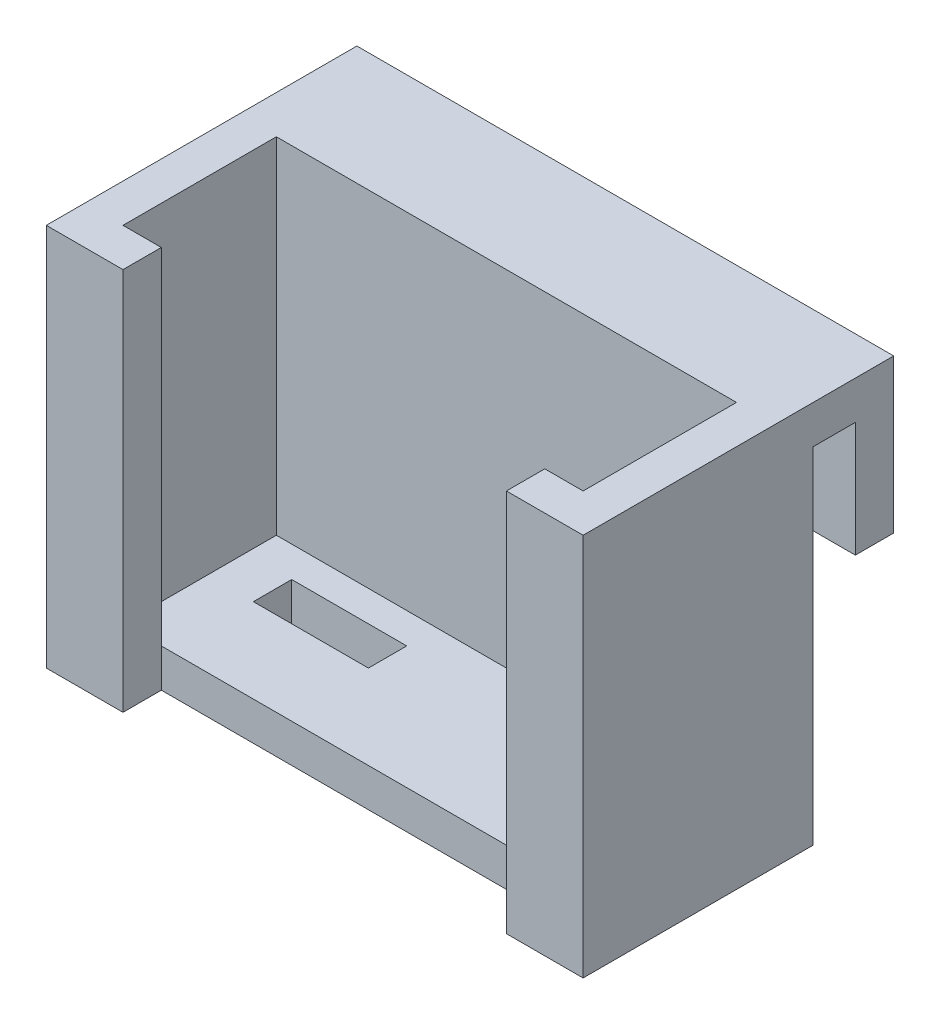
ISO-10303-21;
HEADER;
FILE_DESCRIPTION(('STEP AP214'),'2;1');
FILE_NAME('part.step','',(''),(''),'','','');
FILE_SCHEMA(('AUTOMOTIVE_DESIGN { 1 0 10303 214 1 1 1 1 }'));
ENDSEC;
DATA;
#1=APPLICATION_CONTEXT('core data for automotive mechanical design processes');
#2=APPLICATION_PROTOCOL_DEFINITION('international standard','automotive_design',2000,#1);
#3=PRODUCT_CONTEXT('',#1,'mechanical');
#4=PRODUCT('Part','Part','',(#3));
#5=PRODUCT_RELATED_PRODUCT_CATEGORY('part','',(#4));
#6=PRODUCT_DEFINITION_FORMATION('','',#4);
#7=PRODUCT_DEFINITION_CONTEXT('part definition',#1,'design');
#8=PRODUCT_DEFINITION('design','',#6,#7);
#9=PRODUCT_DEFINITION_SHAPE('','',#8);
#10=(LENGTH_UNIT() NAMED_UNIT(*) SI_UNIT(.MILLI.,.METRE.));
#11=(NAMED_UNIT(*) PLANE_ANGLE_UNIT() SI_UNIT($,.RADIAN.));
#12=(NAMED_UNIT(*) SI_UNIT($,.STERADIAN.) SOLID_ANGLE_UNIT());
#13=UNCERTAINTY_MEASURE_WITH_UNIT(LENGTH_MEASURE(1.E-05),#10,'distance_accuracy_value','');
#14=(GEOMETRIC_REPRESENTATION_CONTEXT(3) GLOBAL_UNCERTAINTY_ASSIGNED_CONTEXT((#13)) GLOBAL_UNIT_ASSIGNED_CONTEXT((#10,
#11,#12)) REPRESENTATION_CONTEXT('',''));
#15=CARTESIAN_POINT('',(0.,0.,0.));
#16=DIRECTION('',(0.,0.,1.));
#17=DIRECTION('',(1.,0.,0.));
#18=AXIS2_PLACEMENT_3D('',#15,#16,#17);
#19=CARTESIAN_POINT('',(30.,5.,9.99999999999999));
#20=DIRECTION('',(0.,0.,-1.));
#21=DIRECTION('',(-1.,0.,0.));
#22=AXIS2_PLACEMENT_3D('',#19,#20,#21);
#23=PLANE('',#22);
#24=DIRECTION('',(0.,1.,0.));
#25=VECTOR('',#24,1.);
#26=CARTESIAN_POINT('',(-25.,0.,10.));
#27=LINE('',#26,#25);
#28=CARTESIAN_POINT('',(-25.,0.,10.));
#29=VERTEX_POINT('',#28);
#30=CARTESIAN_POINT('',(-25.,5.,10.));
#31=VERTEX_POINT('',#30);
#32=EDGE_CURVE('E254',#29,#31,#27,.T.);
#33=ORIENTED_EDGE('',*,*,#32,.F.);
#34=DIRECTION('',(1.,0.,0.));
#35=VECTOR('',#34,1.);
#36=CARTESIAN_POINT('',(30.,0.,9.99999999999999));
#37=LINE('',#36,#35);
#38=CARTESIAN_POINT('',(25.,0.,10.));
#39=VERTEX_POINT('',#38);
#40=EDGE_CURVE('E46',#29,#39,#37,.T.);
#41=ORIENTED_EDGE('',*,*,#40,.T.);
#42=DIRECTION('',(0.,-1.,0.));
#43=VECTOR('',#42,1.);
#44=CARTESIAN_POINT('',(25.,0.,10.));
#45=LINE('',#44,#43);
#46=CARTESIAN_POINT('',(25.,5.,9.99999999999999));
#47=VERTEX_POINT('',#46);
#48=EDGE_CURVE('E11',#47,#39,#45,.T.);
#49=ORIENTED_EDGE('',*,*,#48,.F.);
#50=DIRECTION('',(1.,0.,0.));
#51=VECTOR('',#50,1.);
#52=CARTESIAN_POINT('',(30.,5.,9.99999999999999));
#53=LINE('',#52,#51);
#54=EDGE_CURVE('E69',#31,#47,#53,.T.);
#55=ORIENTED_EDGE('',*,*,#54,.F.);
#56=EDGE_LOOP('',(#33,#41,#49,#55));
#57=FACE_BOUND('',#56,.T.);
#58=ADVANCED_FACE('F43',(#57),#23,.F.);
#59=CARTESIAN_POINT('',(0.,5.,0.));
#60=DIRECTION('',(0.,-1.,0.));
#61=DIRECTION('',(0.,0.,-1.));
#62=AXIS2_PLACEMENT_3D('',#59,#60,#61);
#63=PLANE('',#62);
#64=DIRECTION('',(-1.,0.,0.));
#65=VECTOR('',#64,1.);
#66=CARTESIAN_POINT('',(-8.99999999999999,5.,-6.00000000000001));
#67=LINE('',#66,#65);
#68=CARTESIAN_POINT('',(-8.99999999999999,5.,-6.00000000000001));
#69=VERTEX_POINT('',#68);
#70=CARTESIAN_POINT('',(-24.,5.,-6.));
#71=VERTEX_POINT('',#70);
#72=EDGE_CURVE('E363',#69,#71,#67,.T.);
#73=ORIENTED_EDGE('',*,*,#72,.F.);
#74=DIRECTION('',(0.,0.,-1.));
#75=VECTOR('',#74,1.);
#76=CARTESIAN_POINT('',(-8.99999999999999,5.,-1.00000000000001));
#77=LINE('',#76,#75);
#78=CARTESIAN_POINT('',(-8.99999999999999,5.,-1.00000000000001));
#79=VERTEX_POINT('',#78);
#80=EDGE_CURVE('E332',#79,#69,#77,.T.);
#81=ORIENTED_EDGE('',*,*,#80,.F.);
#82=DIRECTION('',(1.,0.,0.));
#83=VECTOR('',#82,1.);
#84=CARTESIAN_POINT('',(-8.99999999999999,5.,-1.00000000000001));
#85=LINE('',#84,#83);
#86=CARTESIAN_POINT('',(-24.,5.,-1.));
#87=VERTEX_POINT('',#86);
#88=EDGE_CURVE('E348',#87,#79,#85,.T.);
#89=ORIENTED_EDGE('',*,*,#88,.F.);
#90=DIRECTION('',(0.,0.,1.));
#91=VECTOR('',#90,1.);
#92=CARTESIAN_POINT('',(-24.,5.,-1.));
#93=LINE('',#92,#91);
#94=EDGE_CURVE('E367',#71,#87,#93,.T.);
#95=ORIENTED_EDGE('',*,*,#94,.F.);
#96=EDGE_LOOP('',(#73,#81,#89,#95));
#97=FACE_BOUND('',#96,.T.);
#98=DIRECTION('',(0.,0.,1.));
#99=VECTOR('',#98,1.);
#100=CARTESIAN_POINT('',(-30.,5.,-10.));
#101=LINE('',#100,#99);
#102=CARTESIAN_POINT('',(-30.,5.,-10.));
#103=VERTEX_POINT('',#102);
#104=CARTESIAN_POINT('',(-30.,5.,10.));
#105=VERTEX_POINT('',#104);
#106=EDGE_CURVE('E386',#103,#105,#101,.T.);
#107=ORIENTED_EDGE('',*,*,#106,.T.);
#108=EDGE_CURVE('E391',#105,#31,#53,.T.);
#109=ORIENTED_EDGE('',*,*,#108,.T.);
#110=ORIENTED_EDGE('',*,*,#54,.T.);
#111=CARTESIAN_POINT('',(30.,5.,9.99999999999999));
#112=VERTEX_POINT('',#111);
#113=EDGE_CURVE('E390',#47,#112,#53,.T.);
#114=ORIENTED_EDGE('',*,*,#113,.T.);
#115=DIRECTION('',(0.,0.,-1.));
#116=VECTOR('',#115,1.);
#117=CARTESIAN_POINT('',(30.,5.,-10.));
#118=LINE('',#117,#116);
#119=CARTESIAN_POINT('',(30.,5.,-10.));
#120=VERTEX_POINT('',#119);
#121=EDGE_CURVE('E394',#112,#120,#118,.T.);
#122=ORIENTED_EDGE('',*,*,#121,.T.);
#123=DIRECTION('',(-1.,0.,0.));
#124=VECTOR('',#123,1.);
#125=CARTESIAN_POINT('',(30.,5.,-10.));
#126=LINE('',#125,#124);
#127=EDGE_CURVE('E52',#120,#103,#126,.T.);
#128=ORIENTED_EDGE('',*,*,#127,.T.);
#129=EDGE_LOOP('',(#107,#109,#110,#114,#122,#128));
#130=FACE_BOUND('',#129,.T.);
#131=ADVANCED_FACE('F401',(#97,#130),#63,.F.);
#132=CARTESIAN_POINT('',(0.,0.,0.));
#133=DIRECTION('',(0.,-1.,0.));
#134=DIRECTION('',(0.,0.,-1.));
#135=AXIS2_PLACEMENT_3D('',#132,#133,#134);
#136=PLANE('',#135);
#137=DIRECTION('',(0.,0.,-1.));
#138=VECTOR('',#137,1.);
#139=CARTESIAN_POINT('',(-8.99999999999999,0.,-1.00000000000001));
#140=LINE('',#139,#138);
#141=CARTESIAN_POINT('',(-8.99999999999999,0.,-1.00000000000001));
#142=VERTEX_POINT('',#141);
#143=CARTESIAN_POINT('',(-8.99999999999999,0.,-6.00000000000001));
#144=VERTEX_POINT('',#143);
#145=EDGE_CURVE('E343',#142,#144,#140,.T.);
#146=ORIENTED_EDGE('',*,*,#145,.T.);
#147=DIRECTION('',(-1.,0.,0.));
#148=VECTOR('',#147,1.);
#149=CARTESIAN_POINT('',(-8.99999999999999,0.,-6.00000000000001));
#150=LINE('',#149,#148);
#151=CARTESIAN_POINT('',(-24.,0.,-6.));
#152=VERTEX_POINT('',#151);
#153=EDGE_CURVE('E347',#144,#152,#150,.T.);
#154=ORIENTED_EDGE('',*,*,#153,.T.);
#155=DIRECTION('',(0.,0.,1.));
#156=VECTOR('',#155,1.);
#157=CARTESIAN_POINT('',(-24.,0.,-1.));
#158=LINE('',#157,#156);
#159=CARTESIAN_POINT('',(-24.,0.,-1.));
#160=VERTEX_POINT('',#159);
#161=EDGE_CURVE('E352',#152,#160,#158,.T.);
#162=ORIENTED_EDGE('',*,*,#161,.T.);
#163=DIRECTION('',(1.,0.,0.));
#164=VECTOR('',#163,1.);
#165=CARTESIAN_POINT('',(-8.99999999999999,0.,-1.00000000000001));
#166=LINE('',#165,#164);
#167=EDGE_CURVE('E356',#160,#142,#166,.T.);
#168=ORIENTED_EDGE('',*,*,#167,.T.);
#169=EDGE_LOOP('',(#146,#154,#162,#168));
#170=FACE_BOUND('',#169,.T.);
#171=ORIENTED_EDGE('',*,*,#40,.F.);
#172=DIRECTION('',(0.,0.,-1.));
#173=VECTOR('',#172,1.);
#174=CARTESIAN_POINT('',(-25.,0.,15.));
#175=LINE('',#174,#173);
#176=CARTESIAN_POINT('',(-25.,0.,15.));
#177=VERTEX_POINT('',#176);
#178=EDGE_CURVE('E264',#177,#29,#175,.T.);
#179=ORIENTED_EDGE('',*,*,#178,.F.);
#180=DIRECTION('',(1.,0.,0.));
#181=VECTOR('',#180,1.);
#182=CARTESIAN_POINT('',(-35.,0.,15.));
#183=LINE('',#182,#181);
#184=CARTESIAN_POINT('',(-35.,0.,15.));
#185=VERTEX_POINT('',#184);
#186=EDGE_CURVE('E242',#185,#177,#183,.T.);
#187=ORIENTED_EDGE('',*,*,#186,.F.);
#188=DIRECTION('',(0.,0.,1.));
#189=VECTOR('',#188,1.);
#190=CARTESIAN_POINT('',(-35.,0.,-15.));
#191=LINE('',#190,#189);
#192=CARTESIAN_POINT('',(-35.,0.,-15.));
#193=VERTEX_POINT('',#192);
#194=EDGE_CURVE('E298',#193,#185,#191,.T.);
#195=ORIENTED_EDGE('',*,*,#194,.F.);
#196=DIRECTION('',(-1.,0.,0.));
#197=VECTOR('',#196,1.);
#198=CARTESIAN_POINT('',(30.,0.,-15.));
#199=LINE('',#198,#197);
#200=CARTESIAN_POINT('',(35.,0.,-15.));
#201=VERTEX_POINT('',#200);
#202=EDGE_CURVE('E328',#201,#193,#199,.T.);
#203=ORIENTED_EDGE('',*,*,#202,.F.);
#204=DIRECTION('',(0.,0.,-1.));
#205=VECTOR('',#204,1.);
#206=CARTESIAN_POINT('',(35.,0.,-15.));
#207=LINE('',#206,#205);
#208=CARTESIAN_POINT('',(35.,0.,15.));
#209=VERTEX_POINT('',#208);
#210=EDGE_CURVE('E318',#209,#201,#207,.T.);
#211=ORIENTED_EDGE('',*,*,#210,.F.);
#212=DIRECTION('',(1.,0.,0.));
#213=VECTOR('',#212,1.);
#214=CARTESIAN_POINT('',(35.,0.,15.));
#215=LINE('',#214,#213);
#216=CARTESIAN_POINT('',(25.,0.,15.));
#217=VERTEX_POINT('',#216);
#218=EDGE_CURVE('E278',#217,#209,#215,.T.);
#219=ORIENTED_EDGE('',*,*,#218,.F.);
#220=DIRECTION('',(0.,0.,-1.));
#221=VECTOR('',#220,1.);
#222=CARTESIAN_POINT('',(25.,0.,15.));
#223=LINE('',#222,#221);
#224=EDGE_CURVE('E282',#217,#39,#223,.T.);
#225=ORIENTED_EDGE('',*,*,#224,.T.);
#226=EDGE_LOOP('',(#171,#179,#187,#195,#203,#211,#219,#225));
#227=FACE_BOUND('',#226,.T.);
#228=ADVANCED_FACE('F470',(#170,#227),#136,.T.);
#229=CARTESIAN_POINT('',(-8.99999999999999,0.,-1.00000000000001));
#230=DIRECTION('',(1.,0.,0.));
#231=DIRECTION('',(0.,0.,-1.));
#232=AXIS2_PLACEMENT_3D('',#229,#230,#231);
#233=PLANE('',#232);
#234=ORIENTED_EDGE('',*,*,#80,.T.);
#235=DIRECTION('',(0.,1.,0.));
#236=VECTOR('',#235,1.);
#237=CARTESIAN_POINT('',(-8.99999999999999,0.,-6.00000000000001));
#238=LINE('',#237,#236);
#239=EDGE_CURVE('E360',#144,#69,#238,.T.);
#240=ORIENTED_EDGE('',*,*,#239,.F.);
#241=ORIENTED_EDGE('',*,*,#145,.F.);
#242=DIRECTION('',(0.,1.,0.));
#243=VECTOR('',#242,1.);
#244=CARTESIAN_POINT('',(-8.99999999999999,0.,-1.00000000000001));
#245=LINE('',#244,#243);
#246=EDGE_CURVE('E374',#142,#79,#245,.T.);
#247=ORIENTED_EDGE('',*,*,#246,.T.);
#248=EDGE_LOOP('',(#234,#240,#241,#247));
#249=FACE_BOUND('',#248,.T.);
#250=ADVANCED_FACE('F481',(#249),#233,.F.);
#251=CARTESIAN_POINT('',(-8.99999999999999,0.,-1.00000000000001));
#252=DIRECTION('',(0.,0.,1.));
#253=DIRECTION('',(1.,0.,0.));
#254=AXIS2_PLACEMENT_3D('',#251,#252,#253);
#255=PLANE('',#254);
#256=ORIENTED_EDGE('',*,*,#88,.T.);
#257=ORIENTED_EDGE('',*,*,#246,.F.);
#258=ORIENTED_EDGE('',*,*,#167,.F.);
#259=DIRECTION('',(0.,1.,0.));
#260=VECTOR('',#259,1.);
#261=CARTESIAN_POINT('',(-24.,0.,-1.));
#262=LINE('',#261,#260);
#263=EDGE_CURVE('E377',#160,#87,#262,.T.);
#264=ORIENTED_EDGE('',*,*,#263,.T.);
#265=EDGE_LOOP('',(#256,#257,#258,#264));
#266=FACE_BOUND('',#265,.T.);
#267=ADVANCED_FACE('F487',(#266),#255,.F.);
#268=CARTESIAN_POINT('',(-24.,0.,-1.));
#269=DIRECTION('',(-1.,0.,0.));
#270=DIRECTION('',(0.,0.,1.));
#271=AXIS2_PLACEMENT_3D('',#268,#269,#270);
#272=PLANE('',#271);
#273=ORIENTED_EDGE('',*,*,#94,.T.);
#274=ORIENTED_EDGE('',*,*,#263,.F.);
#275=ORIENTED_EDGE('',*,*,#161,.F.);
#276=DIRECTION('',(0.,1.,0.));
#277=VECTOR('',#276,1.);
#278=CARTESIAN_POINT('',(-24.,0.,-6.));
#279=LINE('',#278,#277);
#280=EDGE_CURVE('E380',#152,#71,#279,.T.);
#281=ORIENTED_EDGE('',*,*,#280,.T.);
#282=EDGE_LOOP('',(#273,#274,#275,#281));
#283=FACE_BOUND('',#282,.T.);
#284=ADVANCED_FACE('F493',(#283),#272,.F.);
#285=CARTESIAN_POINT('',(-8.99999999999999,0.,-6.00000000000001));
#286=DIRECTION('',(0.,0.,-1.));
#287=DIRECTION('',(-1.,0.,0.));
#288=AXIS2_PLACEMENT_3D('',#285,#286,#287);
#289=PLANE('',#288);
#290=ORIENTED_EDGE('',*,*,#72,.T.);
#291=ORIENTED_EDGE('',*,*,#280,.F.);
#292=ORIENTED_EDGE('',*,*,#153,.F.);
#293=ORIENTED_EDGE('',*,*,#239,.T.);
#294=EDGE_LOOP('',(#290,#291,#292,#293));
#295=FACE_BOUND('',#294,.T.);
#296=ADVANCED_FACE('F489',(#295),#289,.F.);
#297=CARTESIAN_POINT('',(0.,0.,-10.));
#298=DIRECTION('',(0.,0.,1.));
#299=DIRECTION('',(1.,0.,0.));
#300=AXIS2_PLACEMENT_3D('',#297,#298,#299);
#301=PLANE('',#300);
#302=ORIENTED_EDGE('',*,*,#127,.F.);
#303=DIRECTION('',(0.,-1.,0.));
#304=VECTOR('',#303,1.);
#305=CARTESIAN_POINT('',(30.,0.,-10.));
#306=LINE('',#305,#304);
#307=CARTESIAN_POINT('',(30.,50.,-10.));
#308=VERTEX_POINT('',#307);
#309=EDGE_CURVE('E322',#308,#120,#306,.T.);
#310=ORIENTED_EDGE('',*,*,#309,.F.);
#311=DIRECTION('',(1.,0.,0.));
#312=VECTOR('',#311,1.);
#313=CARTESIAN_POINT('',(30.,50.,-10.));
#314=LINE('',#313,#312);
#315=CARTESIAN_POINT('',(-30.,50.,-10.));
#316=VERTEX_POINT('',#315);
#317=EDGE_CURVE('E333',#316,#308,#314,.T.);
#318=ORIENTED_EDGE('',*,*,#317,.F.);
#319=DIRECTION('',(0.,1.,0.));
#320=VECTOR('',#319,1.);
#321=CARTESIAN_POINT('',(-30.,0.,-10.));
#322=LINE('',#321,#320);
#323=EDGE_CURVE('E336',#103,#316,#322,.T.);
#324=ORIENTED_EDGE('',*,*,#323,.F.);
#325=EDGE_LOOP('',(#302,#310,#318,#324));
#326=FACE_BOUND('',#325,.T.);
#327=ADVANCED_FACE('F492',(#326),#301,.T.);
#328=CARTESIAN_POINT('',(30.,50.,-15.));
#329=DIRECTION('',(0.,-1.,0.));
#330=DIRECTION('',(0.,0.,-1.));
#331=AXIS2_PLACEMENT_3D('',#328,#329,#330);
#332=PLANE('',#331);
#333=ORIENTED_EDGE('',*,*,#317,.T.);
#334=DIRECTION('',(0.,0.,1.));
#335=VECTOR('',#334,1.);
#336=CARTESIAN_POINT('',(30.,50.,-15.));
#337=LINE('',#336,#335);
#338=CARTESIAN_POINT('',(30.,50.,9.99999999999999));
#339=VERTEX_POINT('',#338);
#340=EDGE_CURVE('E305',#308,#339,#337,.T.);
#341=ORIENTED_EDGE('',*,*,#340,.T.);
#342=DIRECTION('',(-1.,0.,0.));
#343=VECTOR('',#342,1.);
#344=CARTESIAN_POINT('',(35.,50.,10.));
#345=LINE('',#344,#343);
#346=CARTESIAN_POINT('',(25.,50.,10.));
#347=VERTEX_POINT('',#346);
#348=EDGE_CURVE('E267',#339,#347,#345,.T.);
#349=ORIENTED_EDGE('',*,*,#348,.T.);
#350=DIRECTION('',(0.,0.,-1.));
#351=VECTOR('',#350,1.);
#352=CARTESIAN_POINT('',(25.,50.,15.));
#353=LINE('',#352,#351);
#354=CARTESIAN_POINT('',(25.,50.,15.));
#355=VERTEX_POINT('',#354);
#356=EDGE_CURVE('E290',#355,#347,#353,.T.);
#357=ORIENTED_EDGE('',*,*,#356,.F.);
#358=DIRECTION('',(-1.,0.,0.));
#359=VECTOR('',#358,1.);
#360=CARTESIAN_POINT('',(35.,50.,15.));
#361=LINE('',#360,#359);
#362=CARTESIAN_POINT('',(35.,50.,15.));
#363=VERTEX_POINT('',#362);
#364=EDGE_CURVE('E272',#363,#355,#361,.T.);
#365=ORIENTED_EDGE('',*,*,#364,.F.);
#366=DIRECTION('',(0.,0.,1.));
#367=VECTOR('',#366,1.);
#368=CARTESIAN_POINT('',(35.,50.,-15.));
#369=LINE('',#368,#367);
#370=CARTESIAN_POINT('',(35.,50.,-25.5));
#371=VERTEX_POINT('',#370);
#372=EDGE_CURVE('E314',#371,#363,#369,.T.);
#373=ORIENTED_EDGE('',*,*,#372,.F.);
#374=DIRECTION('',(1.,0.,0.));
#375=VECTOR('',#374,1.);
#376=CARTESIAN_POINT('',(35.,50.,-25.5));
#377=LINE('',#376,#375);
#378=CARTESIAN_POINT('',(-35.,50.,-25.5));
#379=VERTEX_POINT('',#378);
#380=EDGE_CURVE('E208',#379,#371,#377,.T.);
#381=ORIENTED_EDGE('',*,*,#380,.F.);
#382=DIRECTION('',(0.,0.,-1.));
#383=VECTOR('',#382,1.);
#384=CARTESIAN_POINT('',(-35.,50.,-15.));
#385=LINE('',#384,#383);
#386=CARTESIAN_POINT('',(-35.,50.,15.));
#387=VERTEX_POINT('',#386);
#388=EDGE_CURVE('E302',#387,#379,#385,.T.);
#389=ORIENTED_EDGE('',*,*,#388,.F.);
#390=DIRECTION('',(-1.,0.,0.));
#391=VECTOR('',#390,1.);
#392=CARTESIAN_POINT('',(-35.,50.,15.));
#393=LINE('',#392,#391);
#394=CARTESIAN_POINT('',(-25.,50.,15.));
#395=VERTEX_POINT('',#394);
#396=EDGE_CURVE('E249',#395,#387,#393,.T.);
#397=ORIENTED_EDGE('',*,*,#396,.F.);
#398=DIRECTION('',(0.,0.,-1.));
#399=VECTOR('',#398,1.);
#400=CARTESIAN_POINT('',(-25.,50.,15.));
#401=LINE('',#400,#399);
#402=CARTESIAN_POINT('',(-25.,50.,10.));
#403=VERTEX_POINT('',#402);
#404=EDGE_CURVE('E253',#395,#403,#401,.T.);
#405=ORIENTED_EDGE('',*,*,#404,.T.);
#406=DIRECTION('',(-1.,0.,0.));
#407=VECTOR('',#406,1.);
#408=CARTESIAN_POINT('',(-35.,50.,10.));
#409=LINE('',#408,#407);
#410=CARTESIAN_POINT('',(-30.,50.,10.));
#411=VERTEX_POINT('',#410);
#412=EDGE_CURVE('E243',#403,#411,#409,.T.);
#413=ORIENTED_EDGE('',*,*,#412,.T.);
#414=DIRECTION('',(0.,0.,-1.));
#415=VECTOR('',#414,1.);
#416=CARTESIAN_POINT('',(-30.,50.,-15.));
#417=LINE('',#416,#415);
#418=EDGE_CURVE('E299',#411,#316,#417,.T.);
#419=ORIENTED_EDGE('',*,*,#418,.T.);
#420=EDGE_LOOP('',(#333,#341,#349,#357,#365,#373,#381,#389,#397,#405,#413,#419));
#421=FACE_BOUND('',#420,.T.);
#422=ADVANCED_FACE('F413',(#421),#332,.F.);
#423=CARTESIAN_POINT('',(0.,0.,-15.));
#424=DIRECTION('',(0.,0.,1.));
#425=DIRECTION('',(1.,0.,0.));
#426=AXIS2_PLACEMENT_3D('',#423,#424,#425);
#427=PLANE('',#426);
#428=DIRECTION('',(0.,-1.,0.));
#429=VECTOR('',#428,1.);
#430=CARTESIAN_POINT('',(-35.,0.,-15.));
#431=LINE('',#430,#429);
#432=CARTESIAN_POINT('',(-35.,45.,-15.));
#433=VERTEX_POINT('',#432);
#434=EDGE_CURVE('E295',#433,#193,#431,.T.);
#435=ORIENTED_EDGE('',*,*,#434,.F.);
#436=DIRECTION('',(1.,0.,0.));
#437=VECTOR('',#436,1.);
#438=CARTESIAN_POINT('',(-35.,45.,-15.));
#439=LINE('',#438,#437);
#440=CARTESIAN_POINT('',(35.,45.,-15.));
#441=VERTEX_POINT('',#440);
#442=EDGE_CURVE('E224',#433,#441,#439,.T.);
#443=ORIENTED_EDGE('',*,*,#442,.T.);
#444=DIRECTION('',(0.,1.,0.));
#445=VECTOR('',#444,1.);
#446=CARTESIAN_POINT('',(35.,0.,-15.));
#447=LINE('',#446,#445);
#448=EDGE_CURVE('E311',#201,#441,#447,.T.);
#449=ORIENTED_EDGE('',*,*,#448,.F.);
#450=ORIENTED_EDGE('',*,*,#202,.T.);
#451=EDGE_LOOP('',(#435,#443,#449,#450));
#452=FACE_BOUND('',#451,.T.);
#453=ADVANCED_FACE('F446',(#452),#427,.F.);
#454=CARTESIAN_POINT('',(30.,0.,0.));
#455=DIRECTION('',(1.,0.,0.));
#456=DIRECTION('',(0.,0.,-1.));
#457=AXIS2_PLACEMENT_3D('',#454,#455,#456);
#458=PLANE('',#457);
#459=ORIENTED_EDGE('',*,*,#340,.F.);
#460=ORIENTED_EDGE('',*,*,#309,.T.);
#461=ORIENTED_EDGE('',*,*,#121,.F.);
#462=DIRECTION('',(0.,-1.,0.));
#463=VECTOR('',#462,1.);
#464=CARTESIAN_POINT('',(30.,0.,9.99999999999999));
#465=LINE('',#464,#463);
#466=EDGE_CURVE('E315',#339,#112,#465,.T.);
#467=ORIENTED_EDGE('',*,*,#466,.F.);
#468=EDGE_LOOP('',(#459,#460,#461,#467));
#469=FACE_BOUND('',#468,.T.);
#470=ADVANCED_FACE('F429',(#469),#458,.F.);
#471=CARTESIAN_POINT('',(35.,0.,0.));
#472=DIRECTION('',(1.,0.,0.));
#473=DIRECTION('',(0.,0.,-1.));
#474=AXIS2_PLACEMENT_3D('',#471,#472,#473);
#475=PLANE('',#474);
#476=ORIENTED_EDGE('',*,*,#448,.T.);
#477=DIRECTION('',(0.,0.,-1.));
#478=VECTOR('',#477,1.);
#479=CARTESIAN_POINT('',(35.,45.,-15.));
#480=LINE('',#479,#478);
#481=CARTESIAN_POINT('',(35.,45.,-20.5));
#482=VERTEX_POINT('',#481);
#483=EDGE_CURVE('E61',#441,#482,#480,.T.);
#484=ORIENTED_EDGE('',*,*,#483,.T.);
#485=DIRECTION('',(0.,-1.,0.));
#486=VECTOR('',#485,1.);
#487=CARTESIAN_POINT('',(35.,50.,-20.5));
#488=LINE('',#487,#486);
#489=CARTESIAN_POINT('',(35.,30.,-20.5));
#490=VERTEX_POINT('',#489);
#491=EDGE_CURVE('E216',#482,#490,#488,.T.);
#492=ORIENTED_EDGE('',*,*,#491,.T.);
#493=DIRECTION('',(0.,0.,1.));
#494=VECTOR('',#493,1.);
#495=CARTESIAN_POINT('',(35.,30.,-25.5));
#496=LINE('',#495,#494);
#497=CARTESIAN_POINT('',(35.,30.,-25.5));
#498=VERTEX_POINT('',#497);
#499=EDGE_CURVE('E194',#498,#490,#496,.T.);
#500=ORIENTED_EDGE('',*,*,#499,.F.);
#501=DIRECTION('',(0.,-1.,0.));
#502=VECTOR('',#501,1.);
#503=CARTESIAN_POINT('',(35.,50.,-25.5));
#504=LINE('',#503,#502);
#505=EDGE_CURVE('E202',#371,#498,#504,.T.);
#506=ORIENTED_EDGE('',*,*,#505,.F.);
#507=ORIENTED_EDGE('',*,*,#372,.T.);
#508=DIRECTION('',(0.,1.,0.));
#509=VECTOR('',#508,1.);
#510=CARTESIAN_POINT('',(35.,0.,15.));
#511=LINE('',#510,#509);
#512=EDGE_CURVE('E268',#209,#363,#511,.T.);
#513=ORIENTED_EDGE('',*,*,#512,.F.);
#514=ORIENTED_EDGE('',*,*,#210,.T.);
#515=EDGE_LOOP('',(#476,#484,#492,#500,#506,#507,#513,#514));
#516=FACE_BOUND('',#515,.T.);
#517=ADVANCED_FACE('F214',(#516),#475,.T.);
#518=CARTESIAN_POINT('',(-30.,0.,0.));
#519=DIRECTION('',(1.,0.,0.));
#520=DIRECTION('',(0.,0.,-1.));
#521=AXIS2_PLACEMENT_3D('',#518,#519,#520);
#522=PLANE('',#521);
#523=ORIENTED_EDGE('',*,*,#106,.F.);
#524=ORIENTED_EDGE('',*,*,#323,.T.);
#525=ORIENTED_EDGE('',*,*,#418,.F.);
#526=DIRECTION('',(0.,1.,0.));
#527=VECTOR('',#526,1.);
#528=CARTESIAN_POINT('',(-30.,0.,10.));
#529=LINE('',#528,#527);
#530=EDGE_CURVE('E294',#105,#411,#529,.T.);
#531=ORIENTED_EDGE('',*,*,#530,.F.);
#532=EDGE_LOOP('',(#523,#524,#525,#531));
#533=FACE_BOUND('',#532,.T.);
#534=ADVANCED_FACE('F407',(#533),#522,.T.);
#535=CARTESIAN_POINT('',(-35.,0.,0.));
#536=DIRECTION('',(1.,0.,0.));
#537=DIRECTION('',(0.,0.,-1.));
#538=AXIS2_PLACEMENT_3D('',#535,#536,#537);
#539=PLANE('',#538);
#540=ORIENTED_EDGE('',*,*,#388,.T.);
#541=DIRECTION('',(0.,1.,0.));
#542=VECTOR('',#541,1.);
#543=CARTESIAN_POINT('',(-35.,50.,-25.5));
#544=LINE('',#543,#542);
#545=CARTESIAN_POINT('',(-35.,30.,-25.5));
#546=VERTEX_POINT('',#545);
#547=EDGE_CURVE('E201',#546,#379,#544,.T.);
#548=ORIENTED_EDGE('',*,*,#547,.F.);
#549=DIRECTION('',(0.,0.,1.));
#550=VECTOR('',#549,1.);
#551=CARTESIAN_POINT('',(-35.,30.,-25.5));
#552=LINE('',#551,#550);
#553=CARTESIAN_POINT('',(-35.,30.,-20.5));
#554=VERTEX_POINT('',#553);
#555=EDGE_CURVE('E196',#546,#554,#552,.T.);
#556=ORIENTED_EDGE('',*,*,#555,.T.);
#557=DIRECTION('',(0.,1.,0.));
#558=VECTOR('',#557,1.);
#559=CARTESIAN_POINT('',(-35.,50.,-20.5));
#560=LINE('',#559,#558);
#561=CARTESIAN_POINT('',(-35.,45.,-20.5));
#562=VERTEX_POINT('',#561);
#563=EDGE_CURVE('E211',#554,#562,#560,.T.);
#564=ORIENTED_EDGE('',*,*,#563,.T.);
#565=DIRECTION('',(0.,0.,1.));
#566=VECTOR('',#565,1.);
#567=CARTESIAN_POINT('',(-35.,45.,-15.));
#568=LINE('',#567,#566);
#569=EDGE_CURVE('E219',#562,#433,#568,.T.);
#570=ORIENTED_EDGE('',*,*,#569,.T.);
#571=ORIENTED_EDGE('',*,*,#434,.T.);
#572=ORIENTED_EDGE('',*,*,#194,.T.);
#573=DIRECTION('',(0.,-1.,0.));
#574=VECTOR('',#573,1.);
#575=CARTESIAN_POINT('',(-35.,0.,15.));
#576=LINE('',#575,#574);
#577=EDGE_CURVE('E238',#387,#185,#576,.T.);
#578=ORIENTED_EDGE('',*,*,#577,.F.);
#579=EDGE_LOOP('',(#540,#548,#556,#564,#570,#571,#572,#578));
#580=FACE_BOUND('',#579,.T.);
#581=ADVANCED_FACE('F451',(#580),#539,.F.);
#582=CARTESIAN_POINT('',(0.,0.,10.));
#583=DIRECTION('',(0.,0.,1.));
#584=DIRECTION('',(1.,0.,0.));
#585=AXIS2_PLACEMENT_3D('',#582,#583,#584);
#586=PLANE('',#585);
#587=ORIENTED_EDGE('',*,*,#348,.F.);
#588=ORIENTED_EDGE('',*,*,#466,.T.);
#589=ORIENTED_EDGE('',*,*,#113,.F.);
#590=EDGE_CURVE('E54',#347,#47,#45,.T.);
#591=ORIENTED_EDGE('',*,*,#590,.F.);
#592=EDGE_LOOP('',(#587,#588,#589,#591));
#593=FACE_BOUND('',#592,.T.);
#594=ADVANCED_FACE('F431',(#593),#586,.F.);
#595=CARTESIAN_POINT('',(25.,0.,15.));
#596=DIRECTION('',(1.,0.,0.));
#597=DIRECTION('',(0.,0.,-1.));
#598=AXIS2_PLACEMENT_3D('',#595,#596,#597);
#599=PLANE('',#598);
#600=ORIENTED_EDGE('',*,*,#590,.T.);
#601=ORIENTED_EDGE('',*,*,#48,.T.);
#602=ORIENTED_EDGE('',*,*,#224,.F.);
#603=DIRECTION('',(0.,-1.,0.));
#604=VECTOR('',#603,1.);
#605=CARTESIAN_POINT('',(25.,0.,15.));
#606=LINE('',#605,#604);
#607=EDGE_CURVE('E275',#355,#217,#606,.T.);
#608=ORIENTED_EDGE('',*,*,#607,.F.);
#609=ORIENTED_EDGE('',*,*,#356,.T.);
#610=EDGE_LOOP('',(#600,#601,#602,#608,#609));
#611=FACE_BOUND('',#610,.T.);
#612=ADVANCED_FACE('F436',(#611),#599,.F.);
#613=CARTESIAN_POINT('',(0.,0.,15.));
#614=DIRECTION('',(0.,0.,1.));
#615=DIRECTION('',(1.,0.,0.));
#616=AXIS2_PLACEMENT_3D('',#613,#614,#615);
#617=PLANE('',#616);
#618=ORIENTED_EDGE('',*,*,#512,.T.);
#619=ORIENTED_EDGE('',*,*,#364,.T.);
#620=ORIENTED_EDGE('',*,*,#607,.T.);
#621=ORIENTED_EDGE('',*,*,#218,.T.);
#622=EDGE_LOOP('',(#618,#619,#620,#621));
#623=FACE_BOUND('',#622,.T.);
#624=ADVANCED_FACE('F440',(#623),#617,.T.);
#625=CARTESIAN_POINT('',(0.,0.,10.));
#626=DIRECTION('',(0.,0.,-1.));
#627=DIRECTION('',(-1.,0.,0.));
#628=AXIS2_PLACEMENT_3D('',#625,#626,#627);
#629=PLANE('',#628);
#630=ORIENTED_EDGE('',*,*,#108,.F.);
#631=ORIENTED_EDGE('',*,*,#530,.T.);
#632=ORIENTED_EDGE('',*,*,#412,.F.);
#633=EDGE_CURVE('E237',#31,#403,#27,.T.);
#634=ORIENTED_EDGE('',*,*,#633,.F.);
#635=EDGE_LOOP('',(#630,#631,#632,#634));
#636=FACE_BOUND('',#635,.T.);
#637=ADVANCED_FACE('F411',(#636),#629,.T.);
#638=CARTESIAN_POINT('',(-25.,0.,15.));
#639=DIRECTION('',(-1.,0.,0.));
#640=DIRECTION('',(0.,0.,1.));
#641=AXIS2_PLACEMENT_3D('',#638,#639,#640);
#642=PLANE('',#641);
#643=ORIENTED_EDGE('',*,*,#32,.T.);
#644=ORIENTED_EDGE('',*,*,#633,.T.);
#645=ORIENTED_EDGE('',*,*,#404,.F.);
#646=DIRECTION('',(0.,1.,0.));
#647=VECTOR('',#646,1.);
#648=CARTESIAN_POINT('',(-25.,0.,15.));
#649=LINE('',#648,#647);
#650=EDGE_CURVE('E246',#177,#395,#649,.T.);
#651=ORIENTED_EDGE('',*,*,#650,.F.);
#652=ORIENTED_EDGE('',*,*,#178,.T.);
#653=EDGE_LOOP('',(#643,#644,#645,#651,#652));
#654=FACE_BOUND('',#653,.T.);
#655=ADVANCED_FACE('F418',(#654),#642,.F.);
#656=CARTESIAN_POINT('',(0.,0.,15.));
#657=DIRECTION('',(0.,0.,-1.));
#658=DIRECTION('',(-1.,0.,0.));
#659=AXIS2_PLACEMENT_3D('',#656,#657,#658);
#660=PLANE('',#659);
#661=ORIENTED_EDGE('',*,*,#577,.T.);
#662=ORIENTED_EDGE('',*,*,#186,.T.);
#663=ORIENTED_EDGE('',*,*,#650,.T.);
#664=ORIENTED_EDGE('',*,*,#396,.T.);
#665=EDGE_LOOP('',(#661,#662,#663,#664));
#666=FACE_BOUND('',#665,.T.);
#667=ADVANCED_FACE('F466',(#666),#660,.F.);
#668=CARTESIAN_POINT('',(0.,45.,0.));
#669=DIRECTION('',(0.,-1.,0.));
#670=DIRECTION('',(0.,0.,-1.));
#671=AXIS2_PLACEMENT_3D('',#668,#669,#670);
#672=PLANE('',#671);
#673=ORIENTED_EDGE('',*,*,#569,.F.);
#674=DIRECTION('',(-1.,0.,0.));
#675=VECTOR('',#674,1.);
#676=CARTESIAN_POINT('',(-35.,45.,-20.5));
#677=LINE('',#676,#675);
#678=EDGE_CURVE('E233',#482,#562,#677,.T.);
#679=ORIENTED_EDGE('',*,*,#678,.F.);
#680=ORIENTED_EDGE('',*,*,#483,.F.);
#681=ORIENTED_EDGE('',*,*,#442,.F.);
#682=EDGE_LOOP('',(#673,#679,#680,#681));
#683=FACE_BOUND('',#682,.T.);
#684=ADVANCED_FACE('F448',(#683),#672,.T.);
#685=CARTESIAN_POINT('',(0.,0.,-20.5));
#686=DIRECTION('',(0.,0.,-1.));
#687=DIRECTION('',(-1.,0.,0.));
#688=AXIS2_PLACEMENT_3D('',#685,#686,#687);
#689=PLANE('',#688);
#690=ORIENTED_EDGE('',*,*,#491,.F.);
#691=ORIENTED_EDGE('',*,*,#678,.T.);
#692=ORIENTED_EDGE('',*,*,#563,.F.);
#693=DIRECTION('',(-1.,0.,0.));
#694=VECTOR('',#693,1.);
#695=CARTESIAN_POINT('',(35.,30.,-20.5));
#696=LINE('',#695,#694);
#697=EDGE_CURVE('E455',#490,#554,#696,.T.);
#698=ORIENTED_EDGE('',*,*,#697,.F.);
#699=EDGE_LOOP('',(#690,#691,#692,#698));
#700=FACE_BOUND('',#699,.T.);
#701=ADVANCED_FACE('F529',(#700),#689,.F.);
#702=CARTESIAN_POINT('',(35.,30.,-25.5));
#703=DIRECTION('',(0.,1.,0.));
#704=DIRECTION('',(0.,0.,1.));
#705=AXIS2_PLACEMENT_3D('',#702,#703,#704);
#706=PLANE('',#705);
#707=ORIENTED_EDGE('',*,*,#697,.T.);
#708=ORIENTED_EDGE('',*,*,#555,.F.);
#709=DIRECTION('',(-1.,0.,0.));
#710=VECTOR('',#709,1.);
#711=CARTESIAN_POINT('',(35.,30.,-25.5));
#712=LINE('',#711,#710);
#713=EDGE_CURVE('E190',#498,#546,#712,.T.);
#714=ORIENTED_EDGE('',*,*,#713,.F.);
#715=ORIENTED_EDGE('',*,*,#499,.T.);
#716=EDGE_LOOP('',(#707,#708,#714,#715));
#717=FACE_BOUND('',#716,.T.);
#718=ADVANCED_FACE('F192',(#717),#706,.F.);
#719=CARTESIAN_POINT('',(0.,0.,-25.5));
#720=DIRECTION('',(0.,0.,-1.));
#721=DIRECTION('',(-1.,0.,0.));
#722=AXIS2_PLACEMENT_3D('',#719,#720,#721);
#723=PLANE('',#722);
#724=ORIENTED_EDGE('',*,*,#505,.T.);
#725=ORIENTED_EDGE('',*,*,#713,.T.);
#726=ORIENTED_EDGE('',*,*,#547,.T.);
#727=ORIENTED_EDGE('',*,*,#380,.T.);
#728=EDGE_LOOP('',(#724,#725,#726,#727));
#729=FACE_BOUND('',#728,.T.);
#730=ADVANCED_FACE('F206',(#729),#723,.T.);
#731=CLOSED_SHELL('',(#58,#131,#228,#250,#267,#284,#296,#327,#422,#453,#470,#517,#534,#581,#594,
#612,#624,#637,#655,#667,#684,#701,#718,#730));
#732=MANIFOLD_SOLID_BREP('B2',#731);
#733=ADVANCED_BREP_SHAPE_REPRESENTATION('',(#18,#732),#14);
#734=SHAPE_DEFINITION_REPRESENTATION(#9,#733);
ENDSEC;
END-ISO-10303-21;
